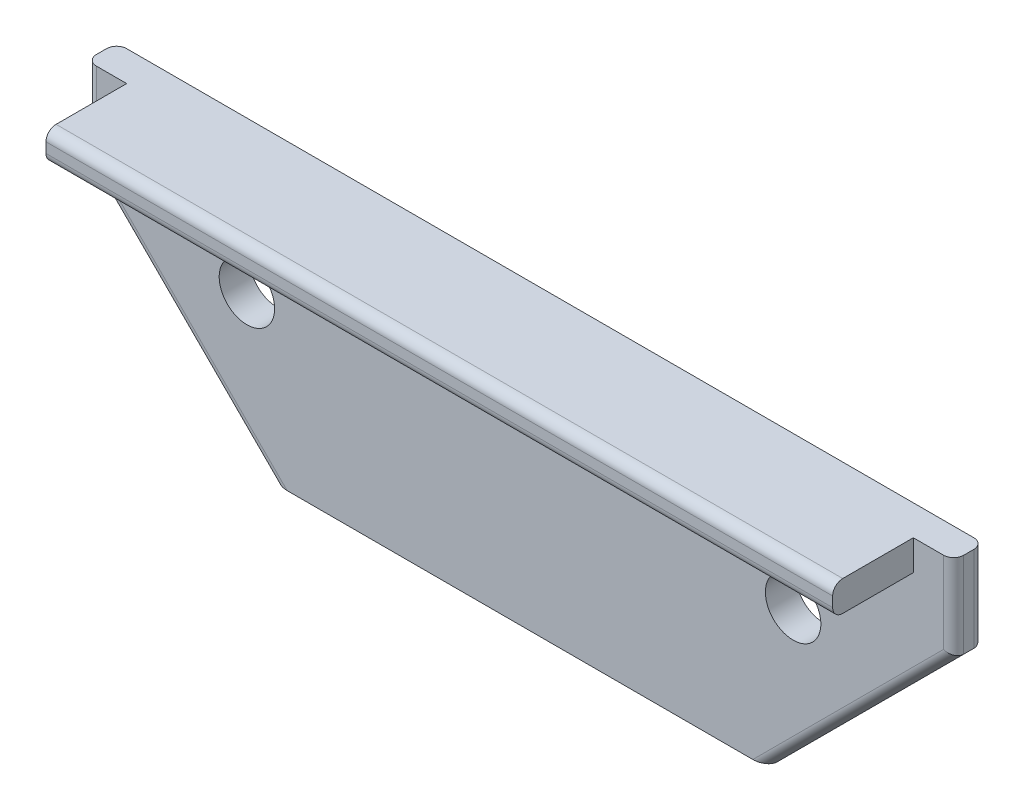
ISO-10303-21;
HEADER;
FILE_DESCRIPTION(('STEP AP214'),'2;1');
FILE_NAME('part.step','',(''),(''),'','','');
FILE_SCHEMA(('AUTOMOTIVE_DESIGN { 1 0 10303 214 1 1 1 1 }'));
ENDSEC;
DATA;
#1=APPLICATION_CONTEXT('core data for automotive mechanical design processes');
#2=APPLICATION_PROTOCOL_DEFINITION('international standard','automotive_design',2000,#1);
#3=PRODUCT_CONTEXT('',#1,'mechanical');
#4=PRODUCT('Part','Part','',(#3));
#5=PRODUCT_RELATED_PRODUCT_CATEGORY('part','',(#4));
#6=PRODUCT_DEFINITION_FORMATION('','',#4);
#7=PRODUCT_DEFINITION_CONTEXT('part definition',#1,'design');
#8=PRODUCT_DEFINITION('design','',#6,#7);
#9=PRODUCT_DEFINITION_SHAPE('','',#8);
#10=(LENGTH_UNIT() NAMED_UNIT(*) SI_UNIT(.MILLI.,.METRE.));
#11=(NAMED_UNIT(*) PLANE_ANGLE_UNIT() SI_UNIT($,.RADIAN.));
#12=(NAMED_UNIT(*) SI_UNIT($,.STERADIAN.) SOLID_ANGLE_UNIT());
#13=UNCERTAINTY_MEASURE_WITH_UNIT(LENGTH_MEASURE(1.E-05),#10,'distance_accuracy_value','');
#14=(GEOMETRIC_REPRESENTATION_CONTEXT(3) GLOBAL_UNCERTAINTY_ASSIGNED_CONTEXT((#13)) GLOBAL_UNIT_ASSIGNED_CONTEXT((#10,
#11,#12)) REPRESENTATION_CONTEXT('',''));
#15=CARTESIAN_POINT('',(0.,0.,0.));
#16=DIRECTION('',(0.,0.,1.));
#17=DIRECTION('',(1.,0.,0.));
#18=AXIS2_PLACEMENT_3D('',#15,#16,#17);
#19=CARTESIAN_POINT('',(0.,0.,-7.9375));
#20=DIRECTION('',(0.,0.,-1.));
#21=DIRECTION('',(-1.,0.,0.));
#22=AXIS2_PLACEMENT_3D('',#19,#20,#21);
#23=PLANE('',#22);
#24=CARTESIAN_POINT('',(85.9789999123034,4.76249999514226,-7.9375));
#25=DIRECTION('',(0.,0.,-1.));
#26=DIRECTION('',(-1.,0.,0.));
#27=AXIS2_PLACEMENT_3D('',#24,#25,#26);
#28=CIRCLE('',#27,8.73124999109411);
#29=CARTESIAN_POINT('',(77.2477499212093,4.76249999514226,-7.9375));
#30=VERTEX_POINT('',#29);
#31=EDGE_CURVE('E289',#30,#30,#28,.T.);
#32=ORIENTED_EDGE('',*,*,#31,.T.);
#33=EDGE_LOOP('',(#32));
#34=FACE_BOUND('',#33,.T.);
#35=CARTESIAN_POINT('',(-85.9789999123005,4.76249999514226,-7.9375));
#36=DIRECTION('',(0.,0.,-1.));
#37=DIRECTION('',(-1.,0.,0.));
#38=AXIS2_PLACEMENT_3D('',#35,#36,#37);
#39=CIRCLE('',#38,8.73124999109411);
#40=CARTESIAN_POINT('',(-94.7102499033946,4.76249999514226,-7.9375));
#41=VERTEX_POINT('',#40);
#42=EDGE_CURVE('E242',#41,#41,#39,.T.);
#43=ORIENTED_EDGE('',*,*,#42,.T.);
#44=EDGE_LOOP('',(#43));
#45=FACE_BOUND('',#44,.T.);
#46=DIRECTION('',(-1.,0.,0.));
#47=VECTOR('',#46,1.);
#48=CARTESIAN_POINT('',(136.524999860745,42.8624999562803,-7.9375));
#49=LINE('',#48,#47);
#50=CARTESIAN_POINT('',(-123.824999873699,42.8624999562803,-7.9375));
#51=VERTEX_POINT('',#50);
#52=CARTESIAN_POINT('',(-133.349999860745,42.8624999562803,-7.9375));
#53=VERTEX_POINT('',#52);
#54=EDGE_CURVE('E228',#51,#53,#49,.T.);
#55=ORIENTED_EDGE('',*,*,#54,.T.);
#56=DIRECTION('',(0.,-1.,0.));
#57=VECTOR('',#56,1.);
#58=CARTESIAN_POINT('',(-133.349999860745,15.8749999838082,-7.9375));
#59=LINE('',#58,#57);
#60=CARTESIAN_POINT('',(-133.349999860745,17.1901280443428,-7.9375));
#61=VERTEX_POINT('',#60);
#62=EDGE_CURVE('E351',#53,#61,#59,.T.);
#63=ORIENTED_EDGE('',*,*,#62,.T.);
#64=DIRECTION('',(0.707106781186556,-0.707106781186539,0.));
#65=VECTOR('',#64,1.);
#66=CARTESIAN_POINT('',(-75.5424358903875,-40.617435926013,-7.9375));
#67=LINE('',#66,#65);
#68=CARTESIAN_POINT('',(-73.2973718601201,-42.8624999562803,-7.9375));
#69=VERTEX_POINT('',#68);
#70=EDGE_CURVE('E348',#61,#69,#67,.T.);
#71=ORIENTED_EDGE('',*,*,#70,.T.);
#72=DIRECTION('',(1.,0.,0.));
#73=VECTOR('',#72,1.);
#74=CARTESIAN_POINT('',(-77.7874999206547,-42.8624999562803,-7.9375));
#75=LINE('',#74,#73);
#76=CARTESIAN_POINT('',(73.2973718601231,-42.8624999562803,-7.9375));
#77=VERTEX_POINT('',#76);
#78=EDGE_CURVE('E227',#69,#77,#75,.T.);
#79=ORIENTED_EDGE('',*,*,#78,.T.);
#80=DIRECTION('',(0.707106781186539,0.707106781186556,0.));
#81=VECTOR('',#80,1.);
#82=CARTESIAN_POINT('',(134.279935830477,18.1200640140755,-7.9375));
#83=LINE('',#82,#81);
#84=CARTESIAN_POINT('',(133.349999860745,17.1901280443428,-7.9375));
#85=VERTEX_POINT('',#84);
#86=EDGE_CURVE('E345',#77,#85,#83,.T.);
#87=ORIENTED_EDGE('',*,*,#86,.T.);
#88=DIRECTION('',(0.,1.,0.));
#89=VECTOR('',#88,1.);
#90=CARTESIAN_POINT('',(133.349999860745,42.8624999562803,-7.9375));
#91=LINE('',#90,#89);
#92=CARTESIAN_POINT('',(133.349999860745,42.8624999562803,-7.9375));
#93=VERTEX_POINT('',#92);
#94=EDGE_CURVE('E225',#85,#93,#91,.T.);
#95=ORIENTED_EDGE('',*,*,#94,.T.);
#96=CARTESIAN_POINT('',(123.824999873699,42.8624999562803,-7.9375));
#97=VERTEX_POINT('',#96);
#98=EDGE_CURVE('E206',#93,#97,#49,.T.);
#99=ORIENTED_EDGE('',*,*,#98,.T.);
#100=DIRECTION('',(0.,1.,0.));
#101=VECTOR('',#100,1.);
#102=CARTESIAN_POINT('',(123.824999873699,42.8624999562803,-7.9375));
#103=LINE('',#102,#101);
#104=CARTESIAN_POINT('',(123.824999873699,33.3374999659958,-7.9375));
#105=VERTEX_POINT('',#104);
#106=EDGE_CURVE('E221',#105,#97,#103,.T.);
#107=ORIENTED_EDGE('',*,*,#106,.F.);
#108=DIRECTION('',(1.,0.,0.));
#109=VECTOR('',#108,1.);
#110=CARTESIAN_POINT('',(123.824999873699,33.3374999659958,-7.9375));
#111=LINE('',#110,#109);
#112=CARTESIAN_POINT('',(-123.824999873699,33.3374999659958,-7.9375));
#113=VERTEX_POINT('',#112);
#114=EDGE_CURVE('E233',#113,#105,#111,.T.);
#115=ORIENTED_EDGE('',*,*,#114,.F.);
#116=DIRECTION('',(0.,-1.,0.));
#117=VECTOR('',#116,1.);
#118=CARTESIAN_POINT('',(-123.824999873699,33.3374999659958,-7.9375));
#119=LINE('',#118,#117);
#120=EDGE_CURVE('E232',#51,#113,#119,.T.);
#121=ORIENTED_EDGE('',*,*,#120,.F.);
#122=EDGE_LOOP('',(#55,#63,#71,#79,#87,#95,#99,#107,#115,#121));
#123=FACE_BOUND('',#122,.T.);
#124=ADVANCED_FACE('F40',(#34,#45,#123),#23,.F.);
#125=CARTESIAN_POINT('',(77.7874999206576,-42.8624999562803,-17.4625));
#126=DIRECTION('',(0.707106781186556,-0.707106781186539,0.));
#127=DIRECTION('',(0.707106781186539,0.707106781186556,0.));
#128=AXIS2_PLACEMENT_3D('',#125,#126,#127);
#129=PLANE('',#128);
#130=DIRECTION('',(0.,0.,1.));
#131=VECTOR('',#130,1.);
#132=CARTESIAN_POINT('',(77.7874999206576,-42.8624999562803,-17.4625));
#133=LINE('',#132,#131);
#134=CARTESIAN_POINT('',(77.7874999206576,-42.8624999562803,-14.2875));
#135=VERTEX_POINT('',#134);
#136=CARTESIAN_POINT('',(77.7874999206576,-42.8624999562803,-11.1125));
#137=VERTEX_POINT('',#136);
#138=EDGE_CURVE('E265',#135,#137,#133,.T.);
#139=ORIENTED_EDGE('',*,*,#138,.F.);
#140=DIRECTION('',(0.707106781186539,0.707106781186556,0.));
#141=VECTOR('',#140,1.);
#142=CARTESIAN_POINT('',(77.7874999206576,-42.8624999562803,-14.2875));
#143=LINE('',#142,#141);
#144=CARTESIAN_POINT('',(136.524999860745,15.8749999838083,-14.2875));
#145=VERTEX_POINT('',#144);
#146=EDGE_CURVE('E365',#135,#145,#143,.T.);
#147=ORIENTED_EDGE('',*,*,#146,.T.);
#148=DIRECTION('',(0.,0.,1.));
#149=VECTOR('',#148,1.);
#150=CARTESIAN_POINT('',(136.524999860745,15.8749999838083,-17.4625));
#151=LINE('',#150,#149);
#152=CARTESIAN_POINT('',(136.524999860745,15.8749999838083,-11.1125));
#153=VERTEX_POINT('',#152);
#154=EDGE_CURVE('E260',#145,#153,#151,.T.);
#155=ORIENTED_EDGE('',*,*,#154,.T.);
#156=DIRECTION('',(0.707106781186539,0.707106781186556,0.));
#157=VECTOR('',#156,1.);
#158=CARTESIAN_POINT('',(77.7874999206576,-42.8624999562803,-11.1125));
#159=LINE('',#158,#157);
#160=EDGE_CURVE('E362',#153,#137,#159,.F.);
#161=ORIENTED_EDGE('',*,*,#160,.T.);
#162=EDGE_LOOP('',(#139,#147,#155,#161));
#163=FACE_BOUND('',#162,.T.);
#164=ADVANCED_FACE('F485',(#163),#129,.T.);
#165=CARTESIAN_POINT('',(-77.7874999206547,-42.8624999562803,-17.4625));
#166=DIRECTION('',(0.,-1.,0.));
#167=DIRECTION('',(0.,0.,-1.));
#168=AXIS2_PLACEMENT_3D('',#165,#166,#167);
#169=PLANE('',#168);
#170=DIRECTION('',(0.,0.,1.));
#171=VECTOR('',#170,1.);
#172=CARTESIAN_POINT('',(-77.7874999206547,-42.8624999562803,-17.4625));
#173=LINE('',#172,#171);
#174=CARTESIAN_POINT('',(-77.7874999206547,-42.8624999562803,-14.2875));
#175=VERTEX_POINT('',#174);
#176=CARTESIAN_POINT('',(-77.7874999206547,-42.8624999562803,-11.1125));
#177=VERTEX_POINT('',#176);
#178=EDGE_CURVE('E270',#175,#177,#173,.T.);
#179=ORIENTED_EDGE('',*,*,#178,.F.);
#180=CARTESIAN_POINT('',(-73.2973718601201,-42.8624999562803,-14.2875));
#181=DIRECTION('',(0.,-1.,0.));
#182=DIRECTION('',(1.,0.,0.));
#183=AXIS2_PLACEMENT_3D('',#180,#181,#182);
#184=ELLIPSE('',#183,4.49012806053463,3.175);
#185=CARTESIAN_POINT('',(-73.2973718601201,-42.8624999562803,-17.4625));
#186=VERTEX_POINT('',#185);
#187=EDGE_CURVE('E310',#175,#186,#184,.T.);
#188=ORIENTED_EDGE('',*,*,#187,.T.);
#189=DIRECTION('',(1.,0.,0.));
#190=VECTOR('',#189,1.);
#191=CARTESIAN_POINT('',(-77.7874999206547,-42.8624999562803,-17.4625));
#192=LINE('',#191,#190);
#193=CARTESIAN_POINT('',(73.2973718601231,-42.8624999562803,-17.4625));
#194=VERTEX_POINT('',#193);
#195=EDGE_CURVE('E257',#186,#194,#192,.T.);
#196=ORIENTED_EDGE('',*,*,#195,.T.);
#197=CARTESIAN_POINT('',(73.2973718601231,-42.8624999562803,-14.2875));
#198=DIRECTION('',(0.,-1.,0.));
#199=DIRECTION('',(1.,0.,0.));
#200=AXIS2_PLACEMENT_3D('',#197,#198,#199);
#201=ELLIPSE('',#200,4.49012806053452,3.175);
#202=EDGE_CURVE('E304',#194,#135,#201,.T.);
#203=ORIENTED_EDGE('',*,*,#202,.T.);
#204=ORIENTED_EDGE('',*,*,#138,.T.);
#205=CARTESIAN_POINT('',(73.2973718601231,-42.8624999562803,-11.1125));
#206=DIRECTION('',(0.,-1.,0.));
#207=DIRECTION('',(-1.,0.,0.));
#208=AXIS2_PLACEMENT_3D('',#205,#206,#207);
#209=ELLIPSE('',#208,4.49012806053452,3.175);
#210=EDGE_CURVE('E301',#137,#77,#209,.T.);
#211=ORIENTED_EDGE('',*,*,#210,.T.);
#212=ORIENTED_EDGE('',*,*,#78,.F.);
#213=CARTESIAN_POINT('',(-73.2973718601201,-42.8624999562803,-11.1125));
#214=DIRECTION('',(0.,-1.,0.));
#215=DIRECTION('',(-1.,0.,0.));
#216=AXIS2_PLACEMENT_3D('',#213,#214,#215);
#217=ELLIPSE('',#216,4.49012806053463,3.175);
#218=EDGE_CURVE('E307',#69,#177,#217,.T.);
#219=ORIENTED_EDGE('',*,*,#218,.T.);
#220=EDGE_LOOP('',(#179,#188,#196,#203,#204,#211,#212,#219));
#221=FACE_BOUND('',#220,.T.);
#222=ADVANCED_FACE('F414',(#221),#169,.T.);
#223=CARTESIAN_POINT('',(-136.524999860745,15.8749999838082,-17.4625));
#224=DIRECTION('',(-0.707106781186539,-0.707106781186556,0.));
#225=DIRECTION('',(0.707106781186556,-0.707106781186539,0.));
#226=AXIS2_PLACEMENT_3D('',#223,#224,#225);
#227=PLANE('',#226);
#228=DIRECTION('',(0.,0.,1.));
#229=VECTOR('',#228,1.);
#230=CARTESIAN_POINT('',(-136.524999860745,15.8749999838082,-17.4625));
#231=LINE('',#230,#229);
#232=CARTESIAN_POINT('',(-136.524999860745,15.8749999838082,-14.2875));
#233=VERTEX_POINT('',#232);
#234=CARTESIAN_POINT('',(-136.524999860745,15.8749999838082,-11.1125));
#235=VERTEX_POINT('',#234);
#236=EDGE_CURVE('E274',#233,#235,#231,.T.);
#237=ORIENTED_EDGE('',*,*,#236,.F.);
#238=DIRECTION('',(0.707106781186556,-0.707106781186539,0.));
#239=VECTOR('',#238,1.);
#240=CARTESIAN_POINT('',(-136.524999860745,15.8749999838082,-14.2875));
#241=LINE('',#240,#239);
#242=EDGE_CURVE('E297',#233,#175,#241,.T.);
#243=ORIENTED_EDGE('',*,*,#242,.T.);
#244=ORIENTED_EDGE('',*,*,#178,.T.);
#245=DIRECTION('',(0.707106781186556,-0.707106781186539,0.));
#246=VECTOR('',#245,1.);
#247=CARTESIAN_POINT('',(-136.524999860745,15.8749999838082,-11.1125));
#248=LINE('',#247,#246);
#249=EDGE_CURVE('E269',#177,#235,#248,.F.);
#250=ORIENTED_EDGE('',*,*,#249,.T.);
#251=EDGE_LOOP('',(#237,#243,#244,#250));
#252=FACE_BOUND('',#251,.T.);
#253=ADVANCED_FACE('F421',(#252),#227,.T.);
#254=CARTESIAN_POINT('',(-136.524999860745,42.8624999562803,-17.4625));
#255=DIRECTION('',(-1.,0.,0.));
#256=DIRECTION('',(0.,0.,1.));
#257=AXIS2_PLACEMENT_3D('',#254,#255,#256);
#258=PLANE('',#257);
#259=DIRECTION('',(0.,0.,1.));
#260=VECTOR('',#259,1.);
#261=CARTESIAN_POINT('',(-136.524999860745,42.8624999562803,-17.4625));
#262=LINE('',#261,#260);
#263=CARTESIAN_POINT('',(-136.524999860745,42.8624999562803,-14.2875));
#264=VERTEX_POINT('',#263);
#265=CARTESIAN_POINT('',(-136.524999860745,42.8624999562803,-11.1125));
#266=VERTEX_POINT('',#265);
#267=EDGE_CURVE('E278',#264,#266,#262,.T.);
#268=ORIENTED_EDGE('',*,*,#267,.F.);
#269=DIRECTION('',(0.,-1.,0.));
#270=VECTOR('',#269,1.);
#271=CARTESIAN_POINT('',(-136.524999860745,42.8624999562803,-14.2875));
#272=LINE('',#271,#270);
#273=EDGE_CURVE('E328',#264,#233,#272,.T.);
#274=ORIENTED_EDGE('',*,*,#273,.T.);
#275=ORIENTED_EDGE('',*,*,#236,.T.);
#276=DIRECTION('',(0.,-1.,0.));
#277=VECTOR('',#276,1.);
#278=CARTESIAN_POINT('',(-136.524999860745,42.8624999562803,-11.1125));
#279=LINE('',#278,#277);
#280=EDGE_CURVE('E325',#235,#266,#279,.F.);
#281=ORIENTED_EDGE('',*,*,#280,.T.);
#282=EDGE_LOOP('',(#268,#274,#275,#281));
#283=FACE_BOUND('',#282,.T.);
#284=ADVANCED_FACE('F426',(#283),#258,.T.);
#285=CARTESIAN_POINT('',(136.524999860745,42.8624999562803,-17.4625));
#286=DIRECTION('',(0.,1.,0.));
#287=DIRECTION('',(0.,0.,1.));
#288=AXIS2_PLACEMENT_3D('',#285,#286,#287);
#289=PLANE('',#288);
#290=DIRECTION('',(-1.,0.,0.));
#291=VECTOR('',#290,1.);
#292=CARTESIAN_POINT('',(136.524999860745,42.8624999562803,-17.4625));
#293=LINE('',#292,#291);
#294=CARTESIAN_POINT('',(133.349999860745,42.8624999562803,-17.4625));
#295=VERTEX_POINT('',#294);
#296=CARTESIAN_POINT('',(-133.349999860745,42.8624999562803,-17.4625));
#297=VERTEX_POINT('',#296);
#298=EDGE_CURVE('E254',#295,#297,#293,.T.);
#299=ORIENTED_EDGE('',*,*,#298,.T.);
#300=CARTESIAN_POINT('',(-133.349999860745,42.8624999562803,-14.2875));
#301=DIRECTION('',(0.,1.,0.));
#302=DIRECTION('',(0.,0.,1.));
#303=AXIS2_PLACEMENT_3D('',#300,#301,#302);
#304=CIRCLE('',#303,3.175);
#305=EDGE_CURVE('E341',#297,#264,#304,.T.);
#306=ORIENTED_EDGE('',*,*,#305,.T.);
#307=ORIENTED_EDGE('',*,*,#267,.T.);
#308=CARTESIAN_POINT('',(-133.349999860745,42.8624999562803,-11.1125));
#309=DIRECTION('',(0.,1.,0.));
#310=DIRECTION('',(0.,0.,1.));
#311=AXIS2_PLACEMENT_3D('',#308,#309,#310);
#312=CIRCLE('',#311,3.175);
#313=EDGE_CURVE('E338',#266,#53,#312,.T.);
#314=ORIENTED_EDGE('',*,*,#313,.T.);
#315=ORIENTED_EDGE('',*,*,#54,.F.);
#316=DIRECTION('',(0.,0.,-1.));
#317=VECTOR('',#316,1.);
#318=CARTESIAN_POINT('',(-123.824999873699,42.8624999562803,17.4625));
#319=LINE('',#318,#317);
#320=CARTESIAN_POINT('',(-123.824999873699,42.8624999562803,14.2875));
#321=VERTEX_POINT('',#320);
#322=EDGE_CURVE('E215',#321,#51,#319,.T.);
#323=ORIENTED_EDGE('',*,*,#322,.F.);
#324=DIRECTION('',(-1.,0.,0.));
#325=VECTOR('',#324,1.);
#326=CARTESIAN_POINT('',(123.824999873699,42.8624999562803,14.2875));
#327=LINE('',#326,#325);
#328=CARTESIAN_POINT('',(123.824999873699,42.8624999562803,14.2875));
#329=VERTEX_POINT('',#328);
#330=EDGE_CURVE('E210',#321,#329,#327,.F.);
#331=ORIENTED_EDGE('',*,*,#330,.T.);
#332=DIRECTION('',(0.,0.,-1.));
#333=VECTOR('',#332,1.);
#334=CARTESIAN_POINT('',(123.824999873699,42.8624999562803,17.4625));
#335=LINE('',#334,#333);
#336=EDGE_CURVE('E202',#329,#97,#335,.T.);
#337=ORIENTED_EDGE('',*,*,#336,.T.);
#338=ORIENTED_EDGE('',*,*,#98,.F.);
#339=CARTESIAN_POINT('',(133.349999860745,42.8624999562803,-11.1125));
#340=DIRECTION('',(0.,1.,0.));
#341=DIRECTION('',(0.,0.,1.));
#342=AXIS2_PLACEMENT_3D('',#339,#340,#341);
#343=CIRCLE('',#342,3.175);
#344=CARTESIAN_POINT('',(136.524999860745,42.8624999562803,-11.1125));
#345=VERTEX_POINT('',#344);
#346=EDGE_CURVE('E331',#93,#345,#343,.T.);
#347=ORIENTED_EDGE('',*,*,#346,.T.);
#348=DIRECTION('',(0.,0.,1.));
#349=VECTOR('',#348,1.);
#350=CARTESIAN_POINT('',(136.524999860745,42.8624999562803,-17.4625));
#351=LINE('',#350,#349);
#352=CARTESIAN_POINT('',(136.524999860745,42.8624999562803,-14.2875));
#353=VERTEX_POINT('',#352);
#354=EDGE_CURVE('E282',#353,#345,#351,.T.);
#355=ORIENTED_EDGE('',*,*,#354,.F.);
#356=CARTESIAN_POINT('',(133.349999860745,42.8624999562803,-14.2875));
#357=DIRECTION('',(0.,1.,0.));
#358=DIRECTION('',(0.,0.,1.));
#359=AXIS2_PLACEMENT_3D('',#356,#357,#358);
#360=CIRCLE('',#359,3.175);
#361=EDGE_CURVE('E336',#353,#295,#360,.T.);
#362=ORIENTED_EDGE('',*,*,#361,.T.);
#363=EDGE_LOOP('',(#299,#306,#307,#314,#315,#323,#331,#337,#338,#347,#355,#362));
#364=FACE_BOUND('',#363,.T.);
#365=ADVANCED_FACE('F205',(#364),#289,.T.);
#366=CARTESIAN_POINT('',(136.524999860745,15.8749999838083,-17.4625));
#367=DIRECTION('',(1.,0.,0.));
#368=DIRECTION('',(0.,0.,-1.));
#369=AXIS2_PLACEMENT_3D('',#366,#367,#368);
#370=PLANE('',#369);
#371=ORIENTED_EDGE('',*,*,#154,.F.);
#372=DIRECTION('',(0.,1.,0.));
#373=VECTOR('',#372,1.);
#374=CARTESIAN_POINT('',(136.524999860745,15.8749999838083,-14.2875));
#375=LINE('',#374,#373);
#376=EDGE_CURVE('E358',#145,#353,#375,.T.);
#377=ORIENTED_EDGE('',*,*,#376,.T.);
#378=ORIENTED_EDGE('',*,*,#354,.T.);
#379=DIRECTION('',(0.,1.,0.));
#380=VECTOR('',#379,1.);
#381=CARTESIAN_POINT('',(136.524999860745,15.8749999838083,-11.1125));
#382=LINE('',#381,#380);
#383=EDGE_CURVE('E355',#345,#153,#382,.F.);
#384=ORIENTED_EDGE('',*,*,#383,.T.);
#385=EDGE_LOOP('',(#371,#377,#378,#384));
#386=FACE_BOUND('',#385,.T.);
#387=ADVANCED_FACE('F460',(#386),#370,.T.);
#388=CARTESIAN_POINT('',(0.,0.,-17.4625));
#389=DIRECTION('',(0.,0.,-1.));
#390=DIRECTION('',(-1.,0.,0.));
#391=AXIS2_PLACEMENT_3D('',#388,#389,#390);
#392=PLANE('',#391);
#393=CARTESIAN_POINT('',(85.9789999123034,4.76249999514226,-17.4625));
#394=DIRECTION('',(0.,0.,-1.));
#395=DIRECTION('',(-1.,0.,0.));
#396=AXIS2_PLACEMENT_3D('',#393,#394,#395);
#397=CIRCLE('',#396,8.73124999109411);
#398=CARTESIAN_POINT('',(77.2477499212093,4.76249999514226,-17.4625));
#399=VERTEX_POINT('',#398);
#400=EDGE_CURVE('E294',#399,#399,#397,.T.);
#401=ORIENTED_EDGE('',*,*,#400,.F.);
#402=EDGE_LOOP('',(#401));
#403=FACE_BOUND('',#402,.T.);
#404=CARTESIAN_POINT('',(-85.9789999123005,4.76249999514226,-17.4625));
#405=DIRECTION('',(0.,0.,-1.));
#406=DIRECTION('',(-1.,0.,0.));
#407=AXIS2_PLACEMENT_3D('',#404,#405,#406);
#408=CIRCLE('',#407,8.73124999109411);
#409=CARTESIAN_POINT('',(-94.7102499033946,4.76249999514226,-17.4625));
#410=VERTEX_POINT('',#409);
#411=EDGE_CURVE('E293',#410,#410,#408,.T.);
#412=ORIENTED_EDGE('',*,*,#411,.F.);
#413=EDGE_LOOP('',(#412));
#414=FACE_BOUND('',#413,.T.);
#415=ORIENTED_EDGE('',*,*,#195,.F.);
#416=DIRECTION('',(0.707106781186556,-0.707106781186539,0.));
#417=VECTOR('',#416,1.);
#418=CARTESIAN_POINT('',(-58.0799359081993,-58.0799359082007,-17.4625));
#419=LINE('',#418,#417);
#420=CARTESIAN_POINT('',(-133.349999860745,17.1901280443428,-17.4625));
#421=VERTEX_POINT('',#420);
#422=EDGE_CURVE('E322',#186,#421,#419,.F.);
#423=ORIENTED_EDGE('',*,*,#422,.T.);
#424=DIRECTION('',(0.,-1.,0.));
#425=VECTOR('',#424,1.);
#426=CARTESIAN_POINT('',(-133.349999860745,0.,-17.4625));
#427=LINE('',#426,#425);
#428=EDGE_CURVE('E319',#421,#297,#427,.F.);
#429=ORIENTED_EDGE('',*,*,#428,.T.);
#430=ORIENTED_EDGE('',*,*,#298,.F.);
#431=DIRECTION('',(0.,1.,0.));
#432=VECTOR('',#431,1.);
#433=CARTESIAN_POINT('',(133.349999860745,0.,-17.4625));
#434=LINE('',#433,#432);
#435=CARTESIAN_POINT('',(133.349999860745,17.1901280443428,-17.4625));
#436=VERTEX_POINT('',#435);
#437=EDGE_CURVE('E316',#295,#436,#434,.F.);
#438=ORIENTED_EDGE('',*,*,#437,.T.);
#439=DIRECTION('',(0.707106781186539,0.707106781186556,0.));
#440=VECTOR('',#439,1.);
#441=CARTESIAN_POINT('',(58.0799359082026,-58.0799359082012,-17.4625));
#442=LINE('',#441,#440);
#443=EDGE_CURVE('E313',#436,#194,#442,.F.);
#444=ORIENTED_EDGE('',*,*,#443,.T.);
#445=EDGE_LOOP('',(#415,#423,#429,#430,#438,#444));
#446=FACE_BOUND('',#445,.T.);
#447=ADVANCED_FACE('F456',(#403,#414,#446),#392,.T.);
#448=CARTESIAN_POINT('',(123.824999873699,33.3374999659958,17.4625));
#449=DIRECTION('',(0.,1.,0.));
#450=DIRECTION('',(0.,0.,1.));
#451=AXIS2_PLACEMENT_3D('',#448,#449,#450);
#452=PLANE('',#451);
#453=DIRECTION('',(0.,0.,-1.));
#454=VECTOR('',#453,1.);
#455=CARTESIAN_POINT('',(123.824999873699,33.3374999659958,17.4625));
#456=LINE('',#455,#454);
#457=CARTESIAN_POINT('',(123.824999873699,33.3374999659958,14.2875));
#458=VERTEX_POINT('',#457);
#459=EDGE_CURVE('E214',#458,#105,#456,.T.);
#460=ORIENTED_EDGE('',*,*,#459,.F.);
#461=DIRECTION('',(1.,0.,0.));
#462=VECTOR('',#461,1.);
#463=CARTESIAN_POINT('',(123.824999873699,33.3374999659958,14.2875));
#464=LINE('',#463,#462);
#465=CARTESIAN_POINT('',(-123.824999873699,33.3374999659958,14.2875));
#466=VERTEX_POINT('',#465);
#467=EDGE_CURVE('E11',#458,#466,#464,.F.);
#468=ORIENTED_EDGE('',*,*,#467,.T.);
#469=DIRECTION('',(0.,0.,-1.));
#470=VECTOR('',#469,1.);
#471=CARTESIAN_POINT('',(-123.824999873699,33.3374999659958,17.4625));
#472=LINE('',#471,#470);
#473=EDGE_CURVE('E246',#466,#113,#472,.T.);
#474=ORIENTED_EDGE('',*,*,#473,.T.);
#475=ORIENTED_EDGE('',*,*,#114,.T.);
#476=EDGE_LOOP('',(#460,#468,#474,#475));
#477=FACE_BOUND('',#476,.T.);
#478=ADVANCED_FACE('F459',(#477),#452,.F.);
#479=CARTESIAN_POINT('',(123.824999873699,42.8624999562803,17.4625));
#480=DIRECTION('',(-1.,0.,0.));
#481=DIRECTION('',(0.,0.,1.));
#482=AXIS2_PLACEMENT_3D('',#479,#480,#481);
#483=PLANE('',#482);
#484=ORIENTED_EDGE('',*,*,#336,.F.);
#485=CARTESIAN_POINT('',(123.824999873699,39.6874999562803,14.2875));
#486=DIRECTION('',(-1.,0.,0.));
#487=DIRECTION('',(0.,0.,1.));
#488=AXIS2_PLACEMENT_3D('',#485,#486,#487);
#489=CIRCLE('',#488,3.175);
#490=CARTESIAN_POINT('',(123.824999873699,39.6874999562803,17.4625));
#491=VERTEX_POINT('',#490);
#492=EDGE_CURVE('E50',#329,#491,#489,.F.);
#493=ORIENTED_EDGE('',*,*,#492,.T.);
#494=DIRECTION('',(0.,1.,0.));
#495=VECTOR('',#494,1.);
#496=CARTESIAN_POINT('',(123.824999873699,42.8624999562803,17.4625));
#497=LINE('',#496,#495);
#498=CARTESIAN_POINT('',(123.824999873699,36.5124999659958,17.4625));
#499=VERTEX_POINT('',#498);
#500=EDGE_CURVE('E239',#499,#491,#497,.T.);
#501=ORIENTED_EDGE('',*,*,#500,.F.);
#502=CARTESIAN_POINT('',(123.824999873699,36.5124999659958,14.2875));
#503=DIRECTION('',(-1.,0.,0.));
#504=DIRECTION('',(0.,0.,1.));
#505=AXIS2_PLACEMENT_3D('',#502,#503,#504);
#506=CIRCLE('',#505,3.175);
#507=EDGE_CURVE('E61',#499,#458,#506,.F.);
#508=ORIENTED_EDGE('',*,*,#507,.T.);
#509=ORIENTED_EDGE('',*,*,#459,.T.);
#510=ORIENTED_EDGE('',*,*,#106,.T.);
#511=EDGE_LOOP('',(#484,#493,#501,#508,#509,#510));
#512=FACE_BOUND('',#511,.T.);
#513=ADVANCED_FACE('F230',(#512),#483,.F.);
#514=CARTESIAN_POINT('',(-123.824999873699,33.3374999659958,17.4625));
#515=DIRECTION('',(1.,0.,0.));
#516=DIRECTION('',(0.,0.,-1.));
#517=AXIS2_PLACEMENT_3D('',#514,#515,#516);
#518=PLANE('',#517);
#519=DIRECTION('',(0.,-1.,0.));
#520=VECTOR('',#519,1.);
#521=CARTESIAN_POINT('',(-123.824999873699,33.3374999659958,17.4625));
#522=LINE('',#521,#520);
#523=CARTESIAN_POINT('',(-123.824999873699,39.6874999562803,17.4625));
#524=VERTEX_POINT('',#523);
#525=CARTESIAN_POINT('',(-123.824999873699,36.5124999659958,17.4625));
#526=VERTEX_POINT('',#525);
#527=EDGE_CURVE('E249',#524,#526,#522,.T.);
#528=ORIENTED_EDGE('',*,*,#527,.F.);
#529=CARTESIAN_POINT('',(-123.824999873699,39.6874999562803,14.2875));
#530=DIRECTION('',(1.,0.,0.));
#531=DIRECTION('',(0.,0.,-1.));
#532=AXIS2_PLACEMENT_3D('',#529,#530,#531);
#533=CIRCLE('',#532,3.175);
#534=EDGE_CURVE('E379',#524,#321,#533,.F.);
#535=ORIENTED_EDGE('',*,*,#534,.T.);
#536=ORIENTED_EDGE('',*,*,#322,.T.);
#537=ORIENTED_EDGE('',*,*,#120,.T.);
#538=ORIENTED_EDGE('',*,*,#473,.F.);
#539=CARTESIAN_POINT('',(-123.824999873699,36.5124999659958,14.2875));
#540=DIRECTION('',(1.,0.,0.));
#541=DIRECTION('',(0.,0.,-1.));
#542=AXIS2_PLACEMENT_3D('',#539,#540,#541);
#543=CIRCLE('',#542,3.175);
#544=EDGE_CURVE('E376',#466,#526,#543,.F.);
#545=ORIENTED_EDGE('',*,*,#544,.T.);
#546=EDGE_LOOP('',(#528,#535,#536,#537,#538,#545));
#547=FACE_BOUND('',#546,.T.);
#548=ADVANCED_FACE('F596',(#547),#518,.F.);
#549=CARTESIAN_POINT('',(0.,0.,17.4625));
#550=DIRECTION('',(0.,0.,-1.));
#551=DIRECTION('',(-1.,0.,0.));
#552=AXIS2_PLACEMENT_3D('',#549,#550,#551);
#553=PLANE('',#552);
#554=ORIENTED_EDGE('',*,*,#500,.T.);
#555=DIRECTION('',(-1.,0.,0.));
#556=VECTOR('',#555,1.);
#557=CARTESIAN_POINT('',(-123.824999873699,39.6874999562803,17.4625));
#558=LINE('',#557,#556);
#559=EDGE_CURVE('E372',#491,#524,#558,.T.);
#560=ORIENTED_EDGE('',*,*,#559,.T.);
#561=ORIENTED_EDGE('',*,*,#527,.T.);
#562=DIRECTION('',(1.,0.,0.));
#563=VECTOR('',#562,1.);
#564=CARTESIAN_POINT('',(0.,36.5124999659958,17.4625));
#565=LINE('',#564,#563);
#566=EDGE_CURVE('E368',#526,#499,#565,.T.);
#567=ORIENTED_EDGE('',*,*,#566,.T.);
#568=EDGE_LOOP('',(#554,#560,#561,#567));
#569=FACE_BOUND('',#568,.T.);
#570=ADVANCED_FACE('F588',(#569),#553,.F.);
#571=CARTESIAN_POINT('',(-85.9789999123005,4.76249999514226,-17.4625));
#572=DIRECTION('',(0.,0.,-1.));
#573=DIRECTION('',(-1.,0.,0.));
#574=AXIS2_PLACEMENT_3D('',#571,#572,#573);
#575=CYLINDRICAL_SURFACE('',#574,8.73124999109411);
#576=ORIENTED_EDGE('',*,*,#411,.T.);
#577=EDGE_LOOP('',(#576));
#578=FACE_BOUND('',#577,.T.);
#579=ORIENTED_EDGE('',*,*,#42,.F.);
#580=EDGE_LOOP('',(#579));
#581=FACE_BOUND('',#580,.T.);
#582=ADVANCED_FACE('F579',(#578,#581),#575,.F.);
#583=CARTESIAN_POINT('',(85.9789999123034,4.76249999514226,-17.4625));
#584=DIRECTION('',(0.,0.,-1.));
#585=DIRECTION('',(-1.,0.,0.));
#586=AXIS2_PLACEMENT_3D('',#583,#584,#585);
#587=CYLINDRICAL_SURFACE('',#586,8.73124999109411);
#588=ORIENTED_EDGE('',*,*,#400,.T.);
#589=EDGE_LOOP('',(#588));
#590=FACE_BOUND('',#589,.T.);
#591=ORIENTED_EDGE('',*,*,#31,.F.);
#592=EDGE_LOOP('',(#591));
#593=FACE_BOUND('',#592,.T.);
#594=ADVANCED_FACE('F453',(#590,#593),#587,.F.);
#595=CARTESIAN_POINT('',(-133.349999860745,42.8624999562803,-14.2875));
#596=DIRECTION('',(0.,-1.,0.));
#597=DIRECTION('',(0.,0.,-1.));
#598=AXIS2_PLACEMENT_3D('',#595,#596,#597);
#599=CYLINDRICAL_SURFACE('',#598,3.175);
#600=ORIENTED_EDGE('',*,*,#305,.F.);
#601=ORIENTED_EDGE('',*,*,#428,.F.);
#602=CARTESIAN_POINT('',(-133.349999860745,17.1901280443428,-14.2875));
#603=DIRECTION('',(0.382683432365096,-0.923879532511284,0.));
#604=DIRECTION('',(-0.923879532511284,-0.382683432365096,0.));
#605=AXIS2_PLACEMENT_3D('',#602,#603,#604);
#606=ELLIPSE('',#605,3.43659523592836,3.175);
#607=EDGE_CURVE('E386',#233,#421,#606,.T.);
#608=ORIENTED_EDGE('',*,*,#607,.F.);
#609=ORIENTED_EDGE('',*,*,#273,.F.);
#610=EDGE_LOOP('',(#600,#601,#608,#609));
#611=FACE_BOUND('',#610,.T.);
#612=ADVANCED_FACE('F474',(#611),#599,.T.);
#613=CARTESIAN_POINT('',(-134.279935830477,18.1200640140756,-14.2875));
#614=DIRECTION('',(0.707106781186556,-0.707106781186539,0.));
#615=DIRECTION('',(0.707106781186539,0.707106781186556,0.));
#616=AXIS2_PLACEMENT_3D('',#613,#614,#615);
#617=CYLINDRICAL_SURFACE('',#616,3.175);
#618=ORIENTED_EDGE('',*,*,#607,.T.);
#619=ORIENTED_EDGE('',*,*,#422,.F.);
#620=ORIENTED_EDGE('',*,*,#187,.F.);
#621=ORIENTED_EDGE('',*,*,#242,.F.);
#622=EDGE_LOOP('',(#618,#619,#620,#621));
#623=FACE_BOUND('',#622,.T.);
#624=ADVANCED_FACE('F470',(#623),#617,.T.);
#625=CARTESIAN_POINT('',(-58.0799359081993,-58.0799359082007,-11.1125));
#626=DIRECTION('',(-0.707106781186556,0.707106781186539,0.));
#627=DIRECTION('',(-0.707106781186539,-0.707106781186556,0.));
#628=AXIS2_PLACEMENT_3D('',#625,#626,#627);
#629=CYLINDRICAL_SURFACE('',#628,3.175);
#630=ORIENTED_EDGE('',*,*,#218,.F.);
#631=ORIENTED_EDGE('',*,*,#70,.F.);
#632=CARTESIAN_POINT('',(-133.349999860745,17.1901280443428,-11.1125));
#633=DIRECTION('',(-0.382683432365096,0.923879532511284,0.));
#634=DIRECTION('',(-0.923879532511284,-0.382683432365096,0.));
#635=AXIS2_PLACEMENT_3D('',#632,#633,#634);
#636=ELLIPSE('',#635,3.43659523592836,3.175);
#637=EDGE_CURVE('E390',#235,#61,#636,.T.);
#638=ORIENTED_EDGE('',*,*,#637,.F.);
#639=ORIENTED_EDGE('',*,*,#249,.F.);
#640=EDGE_LOOP('',(#630,#631,#638,#639));
#641=FACE_BOUND('',#640,.T.);
#642=ADVANCED_FACE('F417',(#641),#629,.T.);
#643=CARTESIAN_POINT('',(-133.349999860745,0.,-11.1125));
#644=DIRECTION('',(0.,1.,0.));
#645=DIRECTION('',(0.,0.,1.));
#646=AXIS2_PLACEMENT_3D('',#643,#644,#645);
#647=CYLINDRICAL_SURFACE('',#646,3.175);
#648=ORIENTED_EDGE('',*,*,#313,.F.);
#649=ORIENTED_EDGE('',*,*,#280,.F.);
#650=ORIENTED_EDGE('',*,*,#637,.T.);
#651=ORIENTED_EDGE('',*,*,#62,.F.);
#652=EDGE_LOOP('',(#648,#649,#650,#651));
#653=FACE_BOUND('',#652,.T.);
#654=ADVANCED_FACE('F430',(#653),#647,.T.);
#655=CARTESIAN_POINT('',(75.5424358903903,-40.6174359260131,-14.2875));
#656=DIRECTION('',(0.707106781186539,0.707106781186556,0.));
#657=DIRECTION('',(-0.707106781186556,0.707106781186539,0.));
#658=AXIS2_PLACEMENT_3D('',#655,#656,#657);
#659=CYLINDRICAL_SURFACE('',#658,3.175);
#660=ORIENTED_EDGE('',*,*,#202,.F.);
#661=ORIENTED_EDGE('',*,*,#443,.F.);
#662=CARTESIAN_POINT('',(133.349999860745,17.1901280443428,-14.2875));
#663=DIRECTION('',(0.382683432365084,0.923879532511289,0.));
#664=DIRECTION('',(0.923879532511289,-0.382683432365084,0.));
#665=AXIS2_PLACEMENT_3D('',#662,#663,#664);
#666=ELLIPSE('',#665,3.43659523592834,3.175);
#667=EDGE_CURVE('E392',#145,#436,#666,.T.);
#668=ORIENTED_EDGE('',*,*,#667,.F.);
#669=ORIENTED_EDGE('',*,*,#146,.F.);
#670=EDGE_LOOP('',(#660,#661,#668,#669));
#671=FACE_BOUND('',#670,.T.);
#672=ADVANCED_FACE('F483',(#671),#659,.T.);
#673=CARTESIAN_POINT('',(133.349999860745,15.8749999838083,-14.2875));
#674=DIRECTION('',(0.,1.,0.));
#675=DIRECTION('',(0.,0.,1.));
#676=AXIS2_PLACEMENT_3D('',#673,#674,#675);
#677=CYLINDRICAL_SURFACE('',#676,3.175);
#678=ORIENTED_EDGE('',*,*,#667,.T.);
#679=ORIENTED_EDGE('',*,*,#437,.F.);
#680=ORIENTED_EDGE('',*,*,#361,.F.);
#681=ORIENTED_EDGE('',*,*,#376,.F.);
#682=EDGE_LOOP('',(#678,#679,#680,#681));
#683=FACE_BOUND('',#682,.T.);
#684=ADVANCED_FACE('F477',(#683),#677,.T.);
#685=CARTESIAN_POINT('',(0.,39.6874999562803,14.2875));
#686=DIRECTION('',(1.,0.,0.));
#687=DIRECTION('',(0.,0.,-1.));
#688=AXIS2_PLACEMENT_3D('',#685,#686,#687);
#689=CYLINDRICAL_SURFACE('',#688,3.175);
#690=ORIENTED_EDGE('',*,*,#492,.F.);
#691=ORIENTED_EDGE('',*,*,#330,.F.);
#692=ORIENTED_EDGE('',*,*,#534,.F.);
#693=ORIENTED_EDGE('',*,*,#559,.F.);
#694=EDGE_LOOP('',(#690,#691,#692,#693));
#695=FACE_BOUND('',#694,.T.);
#696=ADVANCED_FACE('F508',(#695),#689,.T.);
#697=CARTESIAN_POINT('',(133.349999860745,0.,-11.1125));
#698=DIRECTION('',(0.,-1.,0.));
#699=DIRECTION('',(0.,0.,-1.));
#700=AXIS2_PLACEMENT_3D('',#697,#698,#699);
#701=CYLINDRICAL_SURFACE('',#700,3.175);
#702=ORIENTED_EDGE('',*,*,#346,.F.);
#703=ORIENTED_EDGE('',*,*,#94,.F.);
#704=CARTESIAN_POINT('',(133.349999860745,17.1901280443428,-11.1125));
#705=DIRECTION('',(-0.382683432365084,-0.923879532511289,0.));
#706=DIRECTION('',(0.923879532511289,-0.382683432365084,0.));
#707=AXIS2_PLACEMENT_3D('',#704,#705,#706);
#708=ELLIPSE('',#707,3.43659523592834,3.175);
#709=EDGE_CURVE('E44',#153,#85,#708,.T.);
#710=ORIENTED_EDGE('',*,*,#709,.F.);
#711=ORIENTED_EDGE('',*,*,#383,.F.);
#712=EDGE_LOOP('',(#702,#703,#710,#711));
#713=FACE_BOUND('',#712,.T.);
#714=ADVANCED_FACE('F408',(#713),#701,.T.);
#715=CARTESIAN_POINT('',(58.0799359082026,-58.0799359082012,-11.1125));
#716=DIRECTION('',(-0.707106781186539,-0.707106781186556,0.));
#717=DIRECTION('',(0.707106781186556,-0.707106781186539,0.));
#718=AXIS2_PLACEMENT_3D('',#715,#716,#717);
#719=CYLINDRICAL_SURFACE('',#718,3.175);
#720=ORIENTED_EDGE('',*,*,#210,.F.);
#721=ORIENTED_EDGE('',*,*,#160,.F.);
#722=ORIENTED_EDGE('',*,*,#709,.T.);
#723=ORIENTED_EDGE('',*,*,#86,.F.);
#724=EDGE_LOOP('',(#720,#721,#722,#723));
#725=FACE_BOUND('',#724,.T.);
#726=ADVANCED_FACE('F405',(#725),#719,.T.);
#727=CARTESIAN_POINT('',(0.,36.5124999659958,14.2875));
#728=DIRECTION('',(1.,0.,0.));
#729=DIRECTION('',(0.,0.,-1.));
#730=AXIS2_PLACEMENT_3D('',#727,#728,#729);
#731=CYLINDRICAL_SURFACE('',#730,3.175);
#732=ORIENTED_EDGE('',*,*,#544,.F.);
#733=ORIENTED_EDGE('',*,*,#467,.F.);
#734=ORIENTED_EDGE('',*,*,#507,.F.);
#735=ORIENTED_EDGE('',*,*,#566,.F.);
#736=EDGE_LOOP('',(#732,#733,#734,#735));
#737=FACE_BOUND('',#736,.T.);
#738=ADVANCED_FACE('F42',(#737),#731,.T.);
#739=CLOSED_SHELL('',(#124,#164,#222,#253,#284,#365,#387,#447,#478,#513,#548,#570,#582,#594,
#612,#624,#642,#654,#672,#684,#696,#714,#726,#738));
#740=MANIFOLD_SOLID_BREP('B2',#739);
#741=ADVANCED_BREP_SHAPE_REPRESENTATION('',(#18,#740),#14);
#742=SHAPE_DEFINITION_REPRESENTATION(#9,#741);
ENDSEC;
END-ISO-10303-21;
